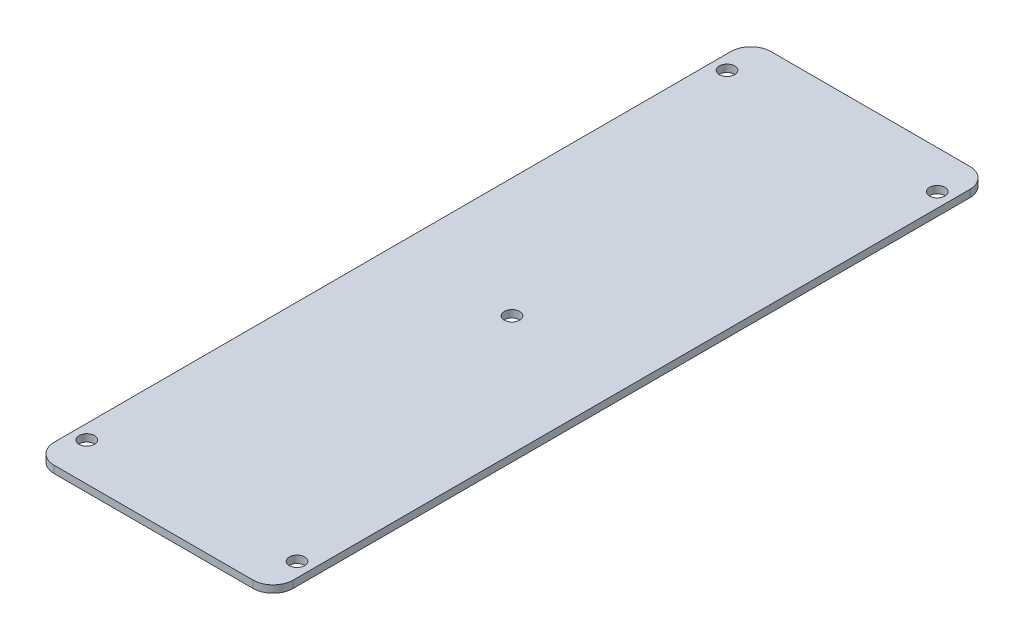
ISO-10303-21;
HEADER;
FILE_DESCRIPTION(('STEP AP214'),'2;1');
FILE_NAME('part.step','',(''),(''),'','','');
FILE_SCHEMA(('AUTOMOTIVE_DESIGN { 1 0 10303 214 1 1 1 1 }'));
ENDSEC;
DATA;
#1=APPLICATION_CONTEXT('core data for automotive mechanical design processes');
#2=APPLICATION_PROTOCOL_DEFINITION('international standard','automotive_design',2000,#1);
#3=PRODUCT_CONTEXT('',#1,'mechanical');
#4=PRODUCT('Part','Part','',(#3));
#5=PRODUCT_RELATED_PRODUCT_CATEGORY('part','',(#4));
#6=PRODUCT_DEFINITION_FORMATION('','',#4);
#7=PRODUCT_DEFINITION_CONTEXT('part definition',#1,'design');
#8=PRODUCT_DEFINITION('design','',#6,#7);
#9=PRODUCT_DEFINITION_SHAPE('','',#8);
#10=(LENGTH_UNIT() NAMED_UNIT(*) SI_UNIT(.MILLI.,.METRE.));
#11=(NAMED_UNIT(*) PLANE_ANGLE_UNIT() SI_UNIT($,.RADIAN.));
#12=(NAMED_UNIT(*) SI_UNIT($,.STERADIAN.) SOLID_ANGLE_UNIT());
#13=UNCERTAINTY_MEASURE_WITH_UNIT(LENGTH_MEASURE(1.E-05),#10,'distance_accuracy_value','');
#14=(GEOMETRIC_REPRESENTATION_CONTEXT(3) GLOBAL_UNCERTAINTY_ASSIGNED_CONTEXT((#13)) GLOBAL_UNIT_ASSIGNED_CONTEXT((#10,
#11,#12)) REPRESENTATION_CONTEXT('',''));
#15=CARTESIAN_POINT('',(0.,0.,0.));
#16=DIRECTION('',(0.,0.,1.));
#17=DIRECTION('',(1.,0.,0.));
#18=AXIS2_PLACEMENT_3D('',#15,#16,#17);
#19=CARTESIAN_POINT('',(3.00000000000004,-4.5254833995939,142.));
#20=DIRECTION('',(0.,1.,0.));
#21=DIRECTION('',(0.,0.,1.));
#22=AXIS2_PLACEMENT_3D('',#19,#20,#21);
#23=CYLINDRICAL_SURFACE('',#22,1.6);
#24=CARTESIAN_POINT('',(3.00000000000004,0.,142.));
#25=DIRECTION('',(0.,1.,0.));
#26=DIRECTION('',(0.,0.,1.));
#27=AXIS2_PLACEMENT_3D('',#24,#25,#26);
#28=CIRCLE('',#27,1.6);
#29=CARTESIAN_POINT('',(3.00000000000004,0.,143.6));
#30=VERTEX_POINT('',#29);
#31=EDGE_CURVE('E146',#30,#30,#28,.F.);
#32=ORIENTED_EDGE('',*,*,#31,.T.);
#33=EDGE_LOOP('',(#32));
#34=FACE_BOUND('',#33,.T.);
#35=CARTESIAN_POINT('',(3.00000000000004,1.524,142.));
#36=DIRECTION('',(0.,1.,0.));
#37=DIRECTION('',(0.,0.,1.));
#38=AXIS2_PLACEMENT_3D('',#35,#36,#37);
#39=CIRCLE('',#38,1.6);
#40=CARTESIAN_POINT('',(3.00000000000004,1.524,143.6));
#41=VERTEX_POINT('',#40);
#42=EDGE_CURVE('E149',#41,#41,#39,.T.);
#43=ORIENTED_EDGE('',*,*,#42,.T.);
#44=EDGE_LOOP('',(#43));
#45=FACE_BOUND('',#44,.T.);
#46=ADVANCED_FACE('F39',(#34,#45),#23,.F.);
#47=CARTESIAN_POINT('',(47.,-4.5254833995939,142.));
#48=DIRECTION('',(0.,1.,0.));
#49=DIRECTION('',(0.,0.,1.));
#50=AXIS2_PLACEMENT_3D('',#47,#48,#49);
#51=CYLINDRICAL_SURFACE('',#50,1.6);
#52=CARTESIAN_POINT('',(47.,0.,142.));
#53=DIRECTION('',(0.,1.,0.));
#54=DIRECTION('',(0.,0.,1.));
#55=AXIS2_PLACEMENT_3D('',#52,#53,#54);
#56=CIRCLE('',#55,1.6);
#57=CARTESIAN_POINT('',(47.,0.,143.6));
#58=VERTEX_POINT('',#57);
#59=EDGE_CURVE('E139',#58,#58,#56,.F.);
#60=ORIENTED_EDGE('',*,*,#59,.T.);
#61=EDGE_LOOP('',(#60));
#62=FACE_BOUND('',#61,.T.);
#63=CARTESIAN_POINT('',(47.,1.524,142.));
#64=DIRECTION('',(0.,1.,0.));
#65=DIRECTION('',(0.,0.,1.));
#66=AXIS2_PLACEMENT_3D('',#63,#64,#65);
#67=CIRCLE('',#66,1.6);
#68=CARTESIAN_POINT('',(47.,1.524,143.6));
#69=VERTEX_POINT('',#68);
#70=EDGE_CURVE('E142',#69,#69,#67,.T.);
#71=ORIENTED_EDGE('',*,*,#70,.T.);
#72=EDGE_LOOP('',(#71));
#73=FACE_BOUND('',#72,.T.);
#74=ADVANCED_FACE('F232',(#62,#73),#51,.F.);
#75=CARTESIAN_POINT('',(0.,1.524,0.));
#76=DIRECTION('',(1.,0.,0.));
#77=DIRECTION('',(0.,0.,-1.));
#78=AXIS2_PLACEMENT_3D('',#75,#76,#77);
#79=PLANE('',#78);
#80=DIRECTION('',(0.,0.,1.));
#81=VECTOR('',#80,1.);
#82=CARTESIAN_POINT('',(0.,0.,0.));
#83=LINE('',#82,#81);
#84=CARTESIAN_POINT('',(0.,0.,4.191));
#85=VERTEX_POINT('',#84);
#86=CARTESIAN_POINT('',(0.,0.,145.809));
#87=VERTEX_POINT('',#86);
#88=EDGE_CURVE('E135',#85,#87,#83,.T.);
#89=ORIENTED_EDGE('',*,*,#88,.T.);
#90=DIRECTION('',(0.,-1.,0.));
#91=VECTOR('',#90,1.);
#92=CARTESIAN_POINT('',(0.,1.524,145.809));
#93=LINE('',#92,#91);
#94=CARTESIAN_POINT('',(0.,1.524,145.809));
#95=VERTEX_POINT('',#94);
#96=EDGE_CURVE('E170',#87,#95,#93,.F.);
#97=ORIENTED_EDGE('',*,*,#96,.T.);
#98=DIRECTION('',(0.,0.,1.));
#99=VECTOR('',#98,1.);
#100=CARTESIAN_POINT('',(0.,1.524,0.));
#101=LINE('',#100,#99);
#102=CARTESIAN_POINT('',(0.,1.524,4.191));
#103=VERTEX_POINT('',#102);
#104=EDGE_CURVE('E133',#103,#95,#101,.T.);
#105=ORIENTED_EDGE('',*,*,#104,.F.);
#106=DIRECTION('',(0.,-1.,0.));
#107=VECTOR('',#106,1.);
#108=CARTESIAN_POINT('',(0.,1.524,4.191));
#109=LINE('',#108,#107);
#110=EDGE_CURVE('E167',#103,#85,#109,.T.);
#111=ORIENTED_EDGE('',*,*,#110,.T.);
#112=EDGE_LOOP('',(#89,#97,#105,#111));
#113=FACE_BOUND('',#112,.T.);
#114=ADVANCED_FACE('F183',(#113),#79,.F.);
#115=CARTESIAN_POINT('',(0.,1.524,150.));
#116=DIRECTION('',(0.,0.,-1.));
#117=DIRECTION('',(-1.,0.,0.));
#118=AXIS2_PLACEMENT_3D('',#115,#116,#117);
#119=PLANE('',#118);
#120=DIRECTION('',(1.,0.,0.));
#121=VECTOR('',#120,1.);
#122=CARTESIAN_POINT('',(0.,0.,150.));
#123=LINE('',#122,#121);
#124=CARTESIAN_POINT('',(4.19100000000002,0.,150.));
#125=VERTEX_POINT('',#124);
#126=CARTESIAN_POINT('',(45.809,0.,150.));
#127=VERTEX_POINT('',#126);
#128=EDGE_CURVE('E131',#125,#127,#123,.T.);
#129=ORIENTED_EDGE('',*,*,#128,.T.);
#130=DIRECTION('',(0.,-1.,0.));
#131=VECTOR('',#130,1.);
#132=CARTESIAN_POINT('',(45.809,1.524,150.));
#133=LINE('',#132,#131);
#134=CARTESIAN_POINT('',(45.809,1.524,150.));
#135=VERTEX_POINT('',#134);
#136=EDGE_CURVE('E109',#127,#135,#133,.F.);
#137=ORIENTED_EDGE('',*,*,#136,.T.);
#138=DIRECTION('',(1.,0.,0.));
#139=VECTOR('',#138,1.);
#140=CARTESIAN_POINT('',(0.,1.524,150.));
#141=LINE('',#140,#139);
#142=CARTESIAN_POINT('',(4.19100000000002,1.524,150.));
#143=VERTEX_POINT('',#142);
#144=EDGE_CURVE('E187',#143,#135,#141,.T.);
#145=ORIENTED_EDGE('',*,*,#144,.F.);
#146=DIRECTION('',(0.,-1.,0.));
#147=VECTOR('',#146,1.);
#148=CARTESIAN_POINT('',(4.19100000000002,1.524,150.));
#149=LINE('',#148,#147);
#150=EDGE_CURVE('E114',#143,#125,#149,.T.);
#151=ORIENTED_EDGE('',*,*,#150,.T.);
#152=EDGE_LOOP('',(#129,#137,#145,#151));
#153=FACE_BOUND('',#152,.T.);
#154=ADVANCED_FACE('F273',(#153),#119,.F.);
#155=CARTESIAN_POINT('',(50.,1.524,0.));
#156=DIRECTION('',(-1.,0.,0.));
#157=DIRECTION('',(0.,0.,1.));
#158=AXIS2_PLACEMENT_3D('',#155,#156,#157);
#159=PLANE('',#158);
#160=DIRECTION('',(0.,0.,-1.));
#161=VECTOR('',#160,1.);
#162=CARTESIAN_POINT('',(50.,1.524,0.));
#163=LINE('',#162,#161);
#164=CARTESIAN_POINT('',(50.,1.524,145.809));
#165=VERTEX_POINT('',#164);
#166=CARTESIAN_POINT('',(50.,1.524,4.191));
#167=VERTEX_POINT('',#166);
#168=EDGE_CURVE('E123',#165,#167,#163,.T.);
#169=ORIENTED_EDGE('',*,*,#168,.F.);
#170=DIRECTION('',(0.,-1.,0.));
#171=VECTOR('',#170,1.);
#172=CARTESIAN_POINT('',(50.,1.524,145.809));
#173=LINE('',#172,#171);
#174=CARTESIAN_POINT('',(50.,0.,145.809));
#175=VERTEX_POINT('',#174);
#176=EDGE_CURVE('E108',#165,#175,#173,.T.);
#177=ORIENTED_EDGE('',*,*,#176,.T.);
#178=DIRECTION('',(0.,0.,-1.));
#179=VECTOR('',#178,1.);
#180=CARTESIAN_POINT('',(50.,0.,0.));
#181=LINE('',#180,#179);
#182=CARTESIAN_POINT('',(50.,0.,4.191));
#183=VERTEX_POINT('',#182);
#184=EDGE_CURVE('E121',#175,#183,#181,.T.);
#185=ORIENTED_EDGE('',*,*,#184,.T.);
#186=DIRECTION('',(0.,-1.,0.));
#187=VECTOR('',#186,1.);
#188=CARTESIAN_POINT('',(50.,1.524,4.191));
#189=LINE('',#188,#187);
#190=EDGE_CURVE('E125',#183,#167,#189,.F.);
#191=ORIENTED_EDGE('',*,*,#190,.T.);
#192=EDGE_LOOP('',(#169,#177,#185,#191));
#193=FACE_BOUND('',#192,.T.);
#194=ADVANCED_FACE('F120',(#193),#159,.F.);
#195=CARTESIAN_POINT('',(0.,1.524,0.));
#196=DIRECTION('',(0.,0.,1.));
#197=DIRECTION('',(1.,0.,0.));
#198=AXIS2_PLACEMENT_3D('',#195,#196,#197);
#199=PLANE('',#198);
#200=DIRECTION('',(-1.,0.,0.));
#201=VECTOR('',#200,1.);
#202=CARTESIAN_POINT('',(0.,0.,0.));
#203=LINE('',#202,#201);
#204=CARTESIAN_POINT('',(45.809,0.,0.));
#205=VERTEX_POINT('',#204);
#206=CARTESIAN_POINT('',(4.191,0.,0.));
#207=VERTEX_POINT('',#206);
#208=EDGE_CURVE('E130',#205,#207,#203,.T.);
#209=ORIENTED_EDGE('',*,*,#208,.T.);
#210=DIRECTION('',(0.,-1.,0.));
#211=VECTOR('',#210,1.);
#212=CARTESIAN_POINT('',(4.191,1.524,0.));
#213=LINE('',#212,#211);
#214=CARTESIAN_POINT('',(4.191,1.524,0.));
#215=VERTEX_POINT('',#214);
#216=EDGE_CURVE('E11',#207,#215,#213,.F.);
#217=ORIENTED_EDGE('',*,*,#216,.T.);
#218=DIRECTION('',(-1.,0.,0.));
#219=VECTOR('',#218,1.);
#220=CARTESIAN_POINT('',(0.,1.524,0.));
#221=LINE('',#220,#219);
#222=CARTESIAN_POINT('',(45.809,1.524,0.));
#223=VERTEX_POINT('',#222);
#224=EDGE_CURVE('E143',#223,#215,#221,.T.);
#225=ORIENTED_EDGE('',*,*,#224,.F.);
#226=DIRECTION('',(0.,-1.,0.));
#227=VECTOR('',#226,1.);
#228=CARTESIAN_POINT('',(45.809,1.524,0.));
#229=LINE('',#228,#227);
#230=EDGE_CURVE('E47',#223,#205,#229,.T.);
#231=ORIENTED_EDGE('',*,*,#230,.T.);
#232=EDGE_LOOP('',(#209,#217,#225,#231));
#233=FACE_BOUND('',#232,.T.);
#234=ADVANCED_FACE('F173',(#233),#199,.F.);
#235=CARTESIAN_POINT('',(0.,1.524,0.));
#236=DIRECTION('',(0.,1.,0.));
#237=DIRECTION('',(0.,0.,1.));
#238=AXIS2_PLACEMENT_3D('',#235,#236,#237);
#239=PLANE('',#238);
#240=CARTESIAN_POINT('',(25.,1.524,75.));
#241=DIRECTION('',(0.,1.,0.));
#242=DIRECTION('',(0.,0.,1.));
#243=AXIS2_PLACEMENT_3D('',#240,#241,#242);
#244=CIRCLE('',#243,1.60000000000001);
#245=CARTESIAN_POINT('',(25.,1.524,76.6));
#246=VERTEX_POINT('',#245);
#247=EDGE_CURVE('E213',#246,#246,#244,.T.);
#248=ORIENTED_EDGE('',*,*,#247,.F.);
#249=EDGE_LOOP('',(#248));
#250=FACE_BOUND('',#249,.T.);
#251=CARTESIAN_POINT('',(3.00000000000002,1.524,8.00000000000001));
#252=DIRECTION('',(0.,1.,0.));
#253=DIRECTION('',(0.,0.,1.));
#254=AXIS2_PLACEMENT_3D('',#251,#252,#253);
#255=CIRCLE('',#254,1.6);
#256=CARTESIAN_POINT('',(3.00000000000002,1.524,9.6));
#257=VERTEX_POINT('',#256);
#258=EDGE_CURVE('E201',#257,#257,#255,.T.);
#259=ORIENTED_EDGE('',*,*,#258,.F.);
#260=EDGE_LOOP('',(#259));
#261=FACE_BOUND('',#260,.T.);
#262=CARTESIAN_POINT('',(47.,1.524,8.00000000000001));
#263=DIRECTION('',(0.,1.,0.));
#264=DIRECTION('',(0.,0.,1.));
#265=AXIS2_PLACEMENT_3D('',#262,#263,#264);
#266=CIRCLE('',#265,1.6);
#267=CARTESIAN_POINT('',(47.,1.524,9.6));
#268=VERTEX_POINT('',#267);
#269=EDGE_CURVE('E197',#268,#268,#266,.T.);
#270=ORIENTED_EDGE('',*,*,#269,.F.);
#271=EDGE_LOOP('',(#270));
#272=FACE_BOUND('',#271,.T.);
#273=ORIENTED_EDGE('',*,*,#144,.T.);
#274=CARTESIAN_POINT('',(45.809,1.524,145.809));
#275=DIRECTION('',(0.,1.,0.));
#276=DIRECTION('',(0.,0.,1.));
#277=AXIS2_PLACEMENT_3D('',#274,#275,#276);
#278=CIRCLE('',#277,4.191);
#279=EDGE_CURVE('E165',#135,#165,#278,.T.);
#280=ORIENTED_EDGE('',*,*,#279,.T.);
#281=ORIENTED_EDGE('',*,*,#168,.T.);
#282=CARTESIAN_POINT('',(45.809,1.524,4.191));
#283=DIRECTION('',(0.,1.,0.));
#284=DIRECTION('',(0.,0.,1.));
#285=AXIS2_PLACEMENT_3D('',#282,#283,#284);
#286=CIRCLE('',#285,4.191);
#287=EDGE_CURVE('E59',#167,#223,#286,.T.);
#288=ORIENTED_EDGE('',*,*,#287,.T.);
#289=ORIENTED_EDGE('',*,*,#224,.T.);
#290=CARTESIAN_POINT('',(4.191,1.524,4.191));
#291=DIRECTION('',(0.,1.,0.));
#292=DIRECTION('',(0.,0.,1.));
#293=AXIS2_PLACEMENT_3D('',#290,#291,#292);
#294=CIRCLE('',#293,4.191);
#295=EDGE_CURVE('E161',#215,#103,#294,.T.);
#296=ORIENTED_EDGE('',*,*,#295,.T.);
#297=ORIENTED_EDGE('',*,*,#104,.T.);
#298=CARTESIAN_POINT('',(4.19100000000002,1.524,145.809));
#299=DIRECTION('',(0.,1.,0.));
#300=DIRECTION('',(0.,0.,1.));
#301=AXIS2_PLACEMENT_3D('',#298,#299,#300);
#302=CIRCLE('',#301,4.191);
#303=EDGE_CURVE('E163',#95,#143,#302,.T.);
#304=ORIENTED_EDGE('',*,*,#303,.T.);
#305=EDGE_LOOP('',(#273,#280,#281,#288,#289,#296,#297,#304));
#306=FACE_BOUND('',#305,.T.);
#307=ORIENTED_EDGE('',*,*,#70,.F.);
#308=EDGE_LOOP('',(#307));
#309=FACE_BOUND('',#308,.T.);
#310=ORIENTED_EDGE('',*,*,#42,.F.);
#311=EDGE_LOOP('',(#310));
#312=FACE_BOUND('',#311,.T.);
#313=ADVANCED_FACE('F219',(#250,#261,#272,#306,#309,#312),#239,.T.);
#314=CARTESIAN_POINT('',(0.,0.,0.));
#315=DIRECTION('',(0.,1.,0.));
#316=DIRECTION('',(0.,0.,1.));
#317=AXIS2_PLACEMENT_3D('',#314,#315,#316);
#318=PLANE('',#317);
#319=CARTESIAN_POINT('',(25.,0.,75.));
#320=DIRECTION('',(0.,1.,0.));
#321=DIRECTION('',(0.,0.,1.));
#322=AXIS2_PLACEMENT_3D('',#319,#320,#321);
#323=CIRCLE('',#322,1.60000000000001);
#324=CARTESIAN_POINT('',(25.,0.,76.6));
#325=VERTEX_POINT('',#324);
#326=EDGE_CURVE('E210',#325,#325,#323,.F.);
#327=ORIENTED_EDGE('',*,*,#326,.F.);
#328=EDGE_LOOP('',(#327));
#329=FACE_BOUND('',#328,.T.);
#330=CARTESIAN_POINT('',(3.00000000000002,0.,8.00000000000001));
#331=DIRECTION('',(0.,1.,0.));
#332=DIRECTION('',(0.,0.,1.));
#333=AXIS2_PLACEMENT_3D('',#330,#331,#332);
#334=CIRCLE('',#333,1.6);
#335=CARTESIAN_POINT('',(3.00000000000002,0.,9.6));
#336=VERTEX_POINT('',#335);
#337=EDGE_CURVE('E205',#336,#336,#334,.F.);
#338=ORIENTED_EDGE('',*,*,#337,.F.);
#339=EDGE_LOOP('',(#338));
#340=FACE_BOUND('',#339,.T.);
#341=CARTESIAN_POINT('',(47.,0.,8.00000000000001));
#342=DIRECTION('',(0.,1.,0.));
#343=DIRECTION('',(0.,0.,1.));
#344=AXIS2_PLACEMENT_3D('',#341,#342,#343);
#345=CIRCLE('',#344,1.6);
#346=CARTESIAN_POINT('',(47.,0.,9.6));
#347=VERTEX_POINT('',#346);
#348=EDGE_CURVE('E192',#347,#347,#345,.F.);
#349=ORIENTED_EDGE('',*,*,#348,.F.);
#350=EDGE_LOOP('',(#349));
#351=FACE_BOUND('',#350,.T.);
#352=ORIENTED_EDGE('',*,*,#184,.F.);
#353=CARTESIAN_POINT('',(45.809,0.,145.809));
#354=DIRECTION('',(0.,1.,0.));
#355=DIRECTION('',(0.,0.,1.));
#356=AXIS2_PLACEMENT_3D('',#353,#354,#355);
#357=CIRCLE('',#356,4.191);
#358=EDGE_CURVE('E104',#175,#127,#357,.F.);
#359=ORIENTED_EDGE('',*,*,#358,.T.);
#360=ORIENTED_EDGE('',*,*,#128,.F.);
#361=CARTESIAN_POINT('',(4.19100000000002,0.,145.809));
#362=DIRECTION('',(0.,1.,0.));
#363=DIRECTION('',(0.,0.,1.));
#364=AXIS2_PLACEMENT_3D('',#361,#362,#363);
#365=CIRCLE('',#364,4.191);
#366=EDGE_CURVE('E115',#125,#87,#365,.F.);
#367=ORIENTED_EDGE('',*,*,#366,.T.);
#368=ORIENTED_EDGE('',*,*,#88,.F.);
#369=CARTESIAN_POINT('',(4.191,0.,4.191));
#370=DIRECTION('',(0.,1.,0.));
#371=DIRECTION('',(0.,0.,1.));
#372=AXIS2_PLACEMENT_3D('',#369,#370,#371);
#373=CIRCLE('',#372,4.191);
#374=EDGE_CURVE('E154',#85,#207,#373,.F.);
#375=ORIENTED_EDGE('',*,*,#374,.T.);
#376=ORIENTED_EDGE('',*,*,#208,.F.);
#377=CARTESIAN_POINT('',(45.809,0.,4.191));
#378=DIRECTION('',(0.,1.,0.));
#379=DIRECTION('',(0.,0.,1.));
#380=AXIS2_PLACEMENT_3D('',#377,#378,#379);
#381=CIRCLE('',#380,4.191);
#382=EDGE_CURVE('E124',#205,#183,#381,.F.);
#383=ORIENTED_EDGE('',*,*,#382,.T.);
#384=EDGE_LOOP('',(#352,#359,#360,#367,#368,#375,#376,#383));
#385=FACE_BOUND('',#384,.T.);
#386=ORIENTED_EDGE('',*,*,#59,.F.);
#387=EDGE_LOOP('',(#386));
#388=FACE_BOUND('',#387,.T.);
#389=ORIENTED_EDGE('',*,*,#31,.F.);
#390=EDGE_LOOP('',(#389));
#391=FACE_BOUND('',#390,.T.);
#392=ADVANCED_FACE('F127',(#329,#340,#351,#385,#388,#391),#318,.F.);
#393=CARTESIAN_POINT('',(47.,-4.5254833995939,8.00000000000001));
#394=DIRECTION('',(0.,1.,0.));
#395=DIRECTION('',(0.,0.,1.));
#396=AXIS2_PLACEMENT_3D('',#393,#394,#395);
#397=CYLINDRICAL_SURFACE('',#396,1.6);
#398=ORIENTED_EDGE('',*,*,#348,.T.);
#399=EDGE_LOOP('',(#398));
#400=FACE_BOUND('',#399,.T.);
#401=ORIENTED_EDGE('',*,*,#269,.T.);
#402=EDGE_LOOP('',(#401));
#403=FACE_BOUND('',#402,.T.);
#404=ADVANCED_FACE('F262',(#400,#403),#397,.F.);
#405=CARTESIAN_POINT('',(3.00000000000002,-4.5254833995939,8.00000000000001));
#406=DIRECTION('',(0.,1.,0.));
#407=DIRECTION('',(0.,0.,1.));
#408=AXIS2_PLACEMENT_3D('',#405,#406,#407);
#409=CYLINDRICAL_SURFACE('',#408,1.6);
#410=ORIENTED_EDGE('',*,*,#337,.T.);
#411=EDGE_LOOP('',(#410));
#412=FACE_BOUND('',#411,.T.);
#413=ORIENTED_EDGE('',*,*,#258,.T.);
#414=EDGE_LOOP('',(#413));
#415=FACE_BOUND('',#414,.T.);
#416=ADVANCED_FACE('F245',(#412,#415),#409,.F.);
#417=CARTESIAN_POINT('',(45.809,1.524,145.809));
#418=DIRECTION('',(0.,-1.,0.));
#419=DIRECTION('',(0.,0.,-1.));
#420=AXIS2_PLACEMENT_3D('',#417,#418,#419);
#421=CYLINDRICAL_SURFACE('',#420,4.191);
#422=ORIENTED_EDGE('',*,*,#279,.F.);
#423=ORIENTED_EDGE('',*,*,#136,.F.);
#424=ORIENTED_EDGE('',*,*,#358,.F.);
#425=ORIENTED_EDGE('',*,*,#176,.F.);
#426=EDGE_LOOP('',(#422,#423,#424,#425));
#427=FACE_BOUND('',#426,.T.);
#428=ADVANCED_FACE('F107',(#427),#421,.T.);
#429=CARTESIAN_POINT('',(4.19100000000002,1.524,145.809));
#430=DIRECTION('',(0.,-1.,0.));
#431=DIRECTION('',(0.,0.,-1.));
#432=AXIS2_PLACEMENT_3D('',#429,#430,#431);
#433=CYLINDRICAL_SURFACE('',#432,4.191);
#434=ORIENTED_EDGE('',*,*,#303,.F.);
#435=ORIENTED_EDGE('',*,*,#96,.F.);
#436=ORIENTED_EDGE('',*,*,#366,.F.);
#437=ORIENTED_EDGE('',*,*,#150,.F.);
#438=EDGE_LOOP('',(#434,#435,#436,#437));
#439=FACE_BOUND('',#438,.T.);
#440=ADVANCED_FACE('F244',(#439),#433,.T.);
#441=CARTESIAN_POINT('',(4.191,1.524,4.191));
#442=DIRECTION('',(0.,-1.,0.));
#443=DIRECTION('',(0.,0.,-1.));
#444=AXIS2_PLACEMENT_3D('',#441,#442,#443);
#445=CYLINDRICAL_SURFACE('',#444,4.191);
#446=ORIENTED_EDGE('',*,*,#295,.F.);
#447=ORIENTED_EDGE('',*,*,#216,.F.);
#448=ORIENTED_EDGE('',*,*,#374,.F.);
#449=ORIENTED_EDGE('',*,*,#110,.F.);
#450=EDGE_LOOP('',(#446,#447,#448,#449));
#451=FACE_BOUND('',#450,.T.);
#452=ADVANCED_FACE('F180',(#451),#445,.T.);
#453=CARTESIAN_POINT('',(45.809,1.524,4.191));
#454=DIRECTION('',(0.,-1.,0.));
#455=DIRECTION('',(0.,0.,-1.));
#456=AXIS2_PLACEMENT_3D('',#453,#454,#455);
#457=CYLINDRICAL_SURFACE('',#456,4.191);
#458=ORIENTED_EDGE('',*,*,#287,.F.);
#459=ORIENTED_EDGE('',*,*,#190,.F.);
#460=ORIENTED_EDGE('',*,*,#382,.F.);
#461=ORIENTED_EDGE('',*,*,#230,.F.);
#462=EDGE_LOOP('',(#458,#459,#460,#461));
#463=FACE_BOUND('',#462,.T.);
#464=ADVANCED_FACE('F41',(#463),#457,.T.);
#465=CARTESIAN_POINT('',(25.,-4.52548339959392,75.));
#466=DIRECTION('',(0.,1.,0.));
#467=DIRECTION('',(0.,0.,1.));
#468=AXIS2_PLACEMENT_3D('',#465,#466,#467);
#469=CYLINDRICAL_SURFACE('',#468,1.60000000000001);
#470=ORIENTED_EDGE('',*,*,#326,.T.);
#471=EDGE_LOOP('',(#470));
#472=FACE_BOUND('',#471,.T.);
#473=ORIENTED_EDGE('',*,*,#247,.T.);
#474=EDGE_LOOP('',(#473));
#475=FACE_BOUND('',#474,.T.);
#476=ADVANCED_FACE('F217',(#472,#475),#469,.F.);
#477=CLOSED_SHELL('',(#46,#74,#114,#154,#194,#234,#313,#392,#404,#416,#428,#440,#452,#464,#476));
#478=MANIFOLD_SOLID_BREP('B2',#477);
#479=ADVANCED_BREP_SHAPE_REPRESENTATION('',(#18,#478),#14);
#480=SHAPE_DEFINITION_REPRESENTATION(#9,#479);
ENDSEC;
END-ISO-10303-21;
